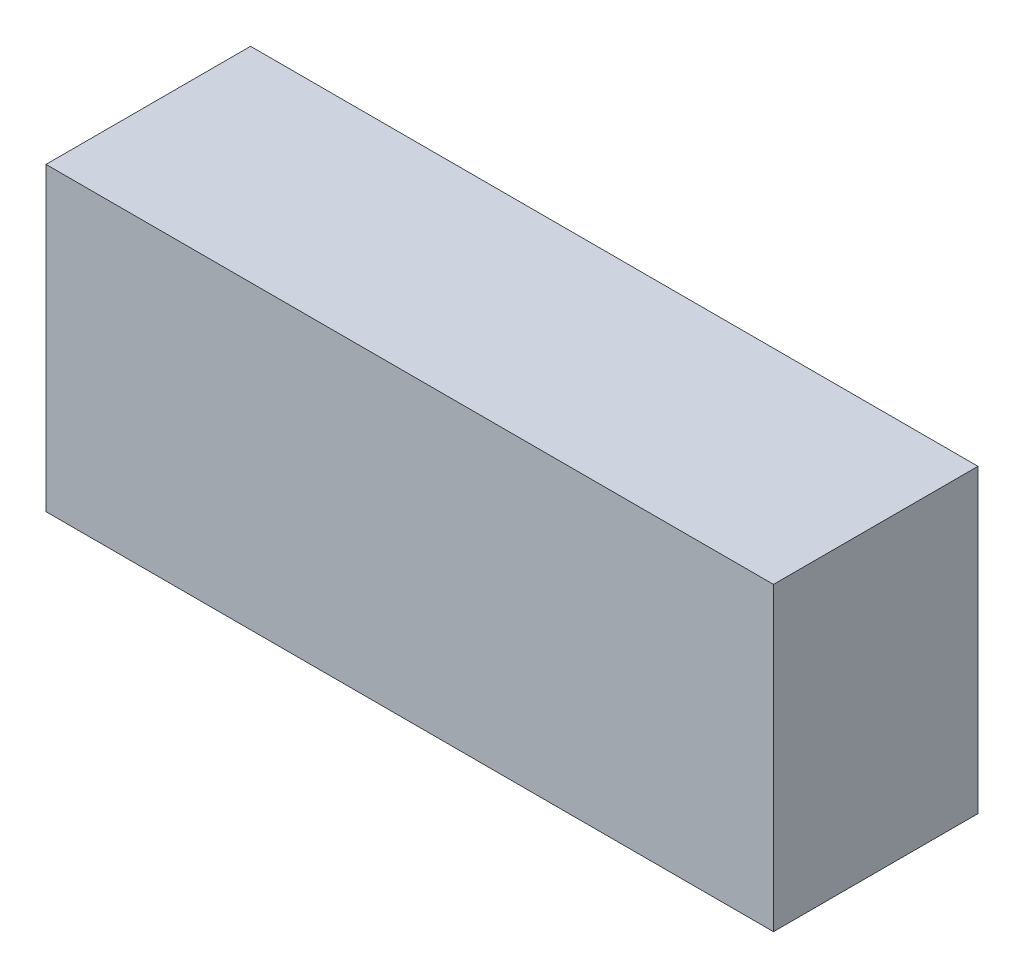
ISO-10303-21;
HEADER;
FILE_DESCRIPTION(('STEP AP214'),'2;1');
FILE_NAME('part.step','',(''),(''),'','','');
FILE_SCHEMA(('AUTOMOTIVE_DESIGN { 1 0 10303 214 1 1 1 1 }'));
ENDSEC;
DATA;
#1=APPLICATION_CONTEXT('core data for automotive mechanical design processes');
#2=APPLICATION_PROTOCOL_DEFINITION('international standard','automotive_design',2000,#1);
#3=PRODUCT_CONTEXT('',#1,'mechanical');
#4=PRODUCT('Part','Part','',(#3));
#5=PRODUCT_RELATED_PRODUCT_CATEGORY('part','',(#4));
#6=PRODUCT_DEFINITION_FORMATION('','',#4);
#7=PRODUCT_DEFINITION_CONTEXT('part definition',#1,'design');
#8=PRODUCT_DEFINITION('design','',#6,#7);
#9=PRODUCT_DEFINITION_SHAPE('','',#8);
#10=(LENGTH_UNIT() NAMED_UNIT(*) SI_UNIT(.MILLI.,.METRE.));
#11=(NAMED_UNIT(*) PLANE_ANGLE_UNIT() SI_UNIT($,.RADIAN.));
#12=(NAMED_UNIT(*) SI_UNIT($,.STERADIAN.) SOLID_ANGLE_UNIT());
#13=UNCERTAINTY_MEASURE_WITH_UNIT(LENGTH_MEASURE(1.E-05),#10,'distance_accuracy_value','');
#14=(GEOMETRIC_REPRESENTATION_CONTEXT(3) GLOBAL_UNCERTAINTY_ASSIGNED_CONTEXT((#13)) GLOBAL_UNIT_ASSIGNED_CONTEXT((#10,
#11,#12)) REPRESENTATION_CONTEXT('',''));
#15=CARTESIAN_POINT('',(0.,0.,0.));
#16=DIRECTION('',(0.,0.,1.));
#17=DIRECTION('',(1.,0.,0.));
#18=AXIS2_PLACEMENT_3D('',#15,#16,#17);
#19=CARTESIAN_POINT('',(-21.5,-8.89,12.09));
#20=DIRECTION('',(1.,0.,0.));
#21=DIRECTION('',(0.,0.,-1.));
#22=AXIS2_PLACEMENT_3D('',#19,#20,#21);
#23=PLANE('',#22);
#24=DIRECTION('',(0.,-1.,0.));
#25=VECTOR('',#24,1.);
#26=CARTESIAN_POINT('',(-21.5,-8.89,0.));
#27=LINE('',#26,#25);
#28=CARTESIAN_POINT('',(-21.5,8.89,0.));
#29=VERTEX_POINT('',#28);
#30=CARTESIAN_POINT('',(-21.5,-8.89,0.));
#31=VERTEX_POINT('',#30);
#32=EDGE_CURVE('E98',#29,#31,#27,.T.);
#33=ORIENTED_EDGE('',*,*,#32,.T.);
#34=DIRECTION('',(0.,0.,-1.));
#35=VECTOR('',#34,1.);
#36=CARTESIAN_POINT('',(-21.5,-8.89,12.09));
#37=LINE('',#36,#35);
#38=CARTESIAN_POINT('',(-21.5,-8.89,12.09));
#39=VERTEX_POINT('',#38);
#40=EDGE_CURVE('E11',#39,#31,#37,.T.);
#41=ORIENTED_EDGE('',*,*,#40,.F.);
#42=DIRECTION('',(0.,-1.,0.));
#43=VECTOR('',#42,1.);
#44=CARTESIAN_POINT('',(-21.5,-8.89,12.09));
#45=LINE('',#44,#43);
#46=CARTESIAN_POINT('',(-21.5,8.89,12.09));
#47=VERTEX_POINT('',#46);
#48=EDGE_CURVE('E86',#47,#39,#45,.T.);
#49=ORIENTED_EDGE('',*,*,#48,.F.);
#50=DIRECTION('',(0.,0.,-1.));
#51=VECTOR('',#50,1.);
#52=CARTESIAN_POINT('',(-21.5,8.89,12.09));
#53=LINE('',#52,#51);
#54=EDGE_CURVE('E94',#47,#29,#53,.T.);
#55=ORIENTED_EDGE('',*,*,#54,.T.);
#56=EDGE_LOOP('',(#33,#41,#49,#55));
#57=FACE_BOUND('',#56,.T.);
#58=ADVANCED_FACE('F35',(#57),#23,.F.);
#59=CARTESIAN_POINT('',(21.5,-8.88999999999999,12.09));
#60=DIRECTION('',(0.,1.,0.));
#61=DIRECTION('',(-1.,0.,0.));
#62=AXIS2_PLACEMENT_3D('',#59,#60,#61);
#63=PLANE('',#62);
#64=DIRECTION('',(1.,0.,0.));
#65=VECTOR('',#64,1.);
#66=CARTESIAN_POINT('',(21.5,-8.88999999999999,0.));
#67=LINE('',#66,#65);
#68=CARTESIAN_POINT('',(21.5,-8.88999999999999,0.));
#69=VERTEX_POINT('',#68);
#70=EDGE_CURVE('E90',#31,#69,#67,.T.);
#71=ORIENTED_EDGE('',*,*,#70,.T.);
#72=DIRECTION('',(0.,0.,-1.));
#73=VECTOR('',#72,1.);
#74=CARTESIAN_POINT('',(21.5,-8.88999999999999,12.09));
#75=LINE('',#74,#73);
#76=CARTESIAN_POINT('',(21.5,-8.88999999999999,12.09));
#77=VERTEX_POINT('',#76);
#78=EDGE_CURVE('E43',#77,#69,#75,.T.);
#79=ORIENTED_EDGE('',*,*,#78,.F.);
#80=DIRECTION('',(1.,0.,0.));
#81=VECTOR('',#80,1.);
#82=CARTESIAN_POINT('',(21.5,-8.88999999999999,12.09));
#83=LINE('',#82,#81);
#84=EDGE_CURVE('E81',#39,#77,#83,.T.);
#85=ORIENTED_EDGE('',*,*,#84,.F.);
#86=ORIENTED_EDGE('',*,*,#40,.T.);
#87=EDGE_LOOP('',(#71,#79,#85,#86));
#88=FACE_BOUND('',#87,.T.);
#89=ADVANCED_FACE('F89',(#88),#63,.F.);
#90=CARTESIAN_POINT('',(21.5,-8.88999999999999,12.09));
#91=DIRECTION('',(-1.,0.,0.));
#92=DIRECTION('',(0.,0.,1.));
#93=AXIS2_PLACEMENT_3D('',#90,#91,#92);
#94=PLANE('',#93);
#95=DIRECTION('',(0.,1.,0.));
#96=VECTOR('',#95,1.);
#97=CARTESIAN_POINT('',(21.5,-8.88999999999999,0.));
#98=LINE('',#97,#96);
#99=CARTESIAN_POINT('',(21.5,8.89000000000001,0.));
#100=VERTEX_POINT('',#99);
#101=EDGE_CURVE('E68',#69,#100,#98,.T.);
#102=ORIENTED_EDGE('',*,*,#101,.T.);
#103=DIRECTION('',(0.,0.,-1.));
#104=VECTOR('',#103,1.);
#105=CARTESIAN_POINT('',(21.5,8.89000000000001,12.09));
#106=LINE('',#105,#104);
#107=CARTESIAN_POINT('',(21.5,8.89000000000001,12.09));
#108=VERTEX_POINT('',#107);
#109=EDGE_CURVE('E91',#108,#100,#106,.T.);
#110=ORIENTED_EDGE('',*,*,#109,.F.);
#111=DIRECTION('',(0.,1.,0.));
#112=VECTOR('',#111,1.);
#113=CARTESIAN_POINT('',(21.5,-8.88999999999999,12.09));
#114=LINE('',#113,#112);
#115=EDGE_CURVE('E84',#77,#108,#114,.T.);
#116=ORIENTED_EDGE('',*,*,#115,.F.);
#117=ORIENTED_EDGE('',*,*,#78,.T.);
#118=EDGE_LOOP('',(#102,#110,#116,#117));
#119=FACE_BOUND('',#118,.T.);
#120=ADVANCED_FACE('F92',(#119),#94,.F.);
#121=CARTESIAN_POINT('',(21.5,8.89000000000001,12.09));
#122=DIRECTION('',(0.,-1.,0.));
#123=DIRECTION('',(1.,0.,0.));
#124=AXIS2_PLACEMENT_3D('',#121,#122,#123);
#125=PLANE('',#124);
#126=DIRECTION('',(-1.,0.,0.));
#127=VECTOR('',#126,1.);
#128=CARTESIAN_POINT('',(21.5,8.89000000000001,0.));
#129=LINE('',#128,#127);
#130=EDGE_CURVE('E74',#100,#29,#129,.T.);
#131=ORIENTED_EDGE('',*,*,#130,.T.);
#132=ORIENTED_EDGE('',*,*,#54,.F.);
#133=DIRECTION('',(-1.,0.,0.));
#134=VECTOR('',#133,1.);
#135=CARTESIAN_POINT('',(21.5,8.89000000000001,12.09));
#136=LINE('',#135,#134);
#137=EDGE_CURVE('E51',#108,#47,#136,.T.);
#138=ORIENTED_EDGE('',*,*,#137,.F.);
#139=ORIENTED_EDGE('',*,*,#109,.T.);
#140=EDGE_LOOP('',(#131,#132,#138,#139));
#141=FACE_BOUND('',#140,.T.);
#142=ADVANCED_FACE('F105',(#141),#125,.F.);
#143=CARTESIAN_POINT('',(0.,0.,12.09));
#144=DIRECTION('',(0.,0.,1.));
#145=DIRECTION('',(1.,0.,0.));
#146=AXIS2_PLACEMENT_3D('',#143,#144,#145);
#147=PLANE('',#146);
#148=ORIENTED_EDGE('',*,*,#48,.T.);
#149=ORIENTED_EDGE('',*,*,#84,.T.);
#150=ORIENTED_EDGE('',*,*,#115,.T.);
#151=ORIENTED_EDGE('',*,*,#137,.T.);
#152=EDGE_LOOP('',(#148,#149,#150,#151));
#153=FACE_BOUND('',#152,.T.);
#154=ADVANCED_FACE('F82',(#153),#147,.T.);
#155=CARTESIAN_POINT('',(0.,0.,0.));
#156=DIRECTION('',(0.,0.,1.));
#157=DIRECTION('',(1.,0.,0.));
#158=AXIS2_PLACEMENT_3D('',#155,#156,#157);
#159=PLANE('',#158);
#160=ORIENTED_EDGE('',*,*,#32,.F.);
#161=ORIENTED_EDGE('',*,*,#130,.F.);
#162=ORIENTED_EDGE('',*,*,#101,.F.);
#163=ORIENTED_EDGE('',*,*,#70,.F.);
#164=EDGE_LOOP('',(#160,#161,#162,#163));
#165=FACE_BOUND('',#164,.T.);
#166=ADVANCED_FACE('F108',(#165),#159,.F.);
#167=CLOSED_SHELL('',(#58,#89,#120,#142,#154,#166));
#168=MANIFOLD_SOLID_BREP('B2',#167);
#169=ADVANCED_BREP_SHAPE_REPRESENTATION('',(#18,#168),#14);
#170=SHAPE_DEFINITION_REPRESENTATION(#9,#169);
ENDSEC;
END-ISO-10303-21;
